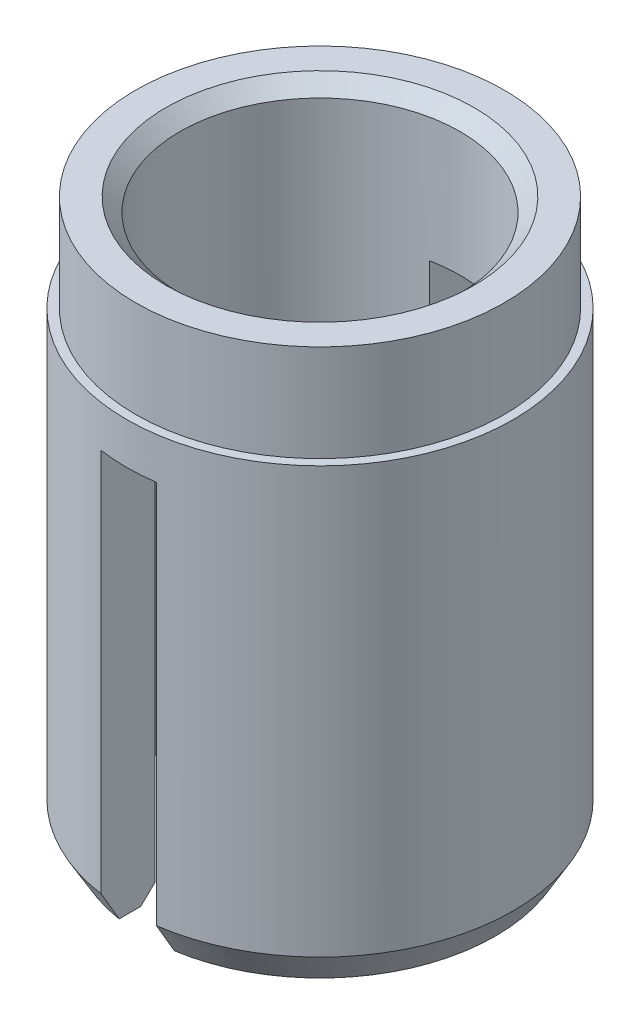
ISO-10303-21;
HEADER;
FILE_DESCRIPTION(('STEP AP214'),'2;1');
FILE_NAME('part.step','',(''),(''),'','','');
FILE_SCHEMA(('AUTOMOTIVE_DESIGN { 1 0 10303 214 1 1 1 1 }'));
ENDSEC;
DATA;
#1=APPLICATION_CONTEXT('core data for automotive mechanical design processes');
#2=APPLICATION_PROTOCOL_DEFINITION('international standard','automotive_design',2000,#1);
#3=PRODUCT_CONTEXT('',#1,'mechanical');
#4=PRODUCT('Part','Part','',(#3));
#5=PRODUCT_RELATED_PRODUCT_CATEGORY('part','',(#4));
#6=PRODUCT_DEFINITION_FORMATION('','',#4);
#7=PRODUCT_DEFINITION_CONTEXT('part definition',#1,'design');
#8=PRODUCT_DEFINITION('design','',#6,#7);
#9=PRODUCT_DEFINITION_SHAPE('','',#8);
#10=(LENGTH_UNIT() NAMED_UNIT(*) SI_UNIT(.MILLI.,.METRE.));
#11=(NAMED_UNIT(*) PLANE_ANGLE_UNIT() SI_UNIT($,.RADIAN.));
#12=(NAMED_UNIT(*) SI_UNIT($,.STERADIAN.) SOLID_ANGLE_UNIT());
#13=UNCERTAINTY_MEASURE_WITH_UNIT(LENGTH_MEASURE(1.E-05),#10,'distance_accuracy_value','');
#14=(GEOMETRIC_REPRESENTATION_CONTEXT(3) GLOBAL_UNCERTAINTY_ASSIGNED_CONTEXT((#13)) GLOBAL_UNIT_ASSIGNED_CONTEXT((#10,
#11,#12)) REPRESENTATION_CONTEXT('',''));
#15=CARTESIAN_POINT('',(0.,0.,0.));
#16=DIRECTION('',(0.,0.,1.));
#17=DIRECTION('',(1.,0.,0.));
#18=AXIS2_PLACEMENT_3D('',#15,#16,#17);
#19=CARTESIAN_POINT('',(0.,4.7625,0.));
#20=DIRECTION('',(0.,-1.,0.));
#21=DIRECTION('',(0.,0.,-1.));
#22=AXIS2_PLACEMENT_3D('',#19,#20,#21);
#23=CYLINDRICAL_SURFACE('',#22,3.3274);
#24=CARTESIAN_POINT('',(0.,3.095625,0.));
#25=DIRECTION('',(0.,1.,0.));
#26=DIRECTION('',(0.,0.,1.));
#27=AXIS2_PLACEMENT_3D('',#24,#25,#26);
#28=CIRCLE('',#27,3.3274);
#29=CARTESIAN_POINT('',(0.,3.095625,3.3274));
#30=VERTEX_POINT('',#29);
#31=EDGE_CURVE('E167',#30,#30,#28,.T.);
#32=ORIENTED_EDGE('',*,*,#31,.F.);
#33=EDGE_LOOP('',(#32));
#34=FACE_BOUND('',#33,.T.);
#35=DIRECTION('',(0.,-1.,0.));
#36=VECTOR('',#35,1.);
#37=CARTESIAN_POINT('',(0.476250000000001,4.7625,-3.29314085600662));
#38=LINE('',#37,#36);
#39=CARTESIAN_POINT('',(0.47625,2.38125,-3.29314085600662));
#40=VERTEX_POINT('',#39);
#41=CARTESIAN_POINT('',(0.476249999999999,-4.23457091385299,-3.29314085600662));
#42=VERTEX_POINT('',#41);
#43=EDGE_CURVE('E55',#40,#42,#38,.T.);
#44=ORIENTED_EDGE('',*,*,#43,.F.);
#45=CARTESIAN_POINT('',(0.,2.38125,0.));
#46=DIRECTION('',(0.,-1.,0.));
#47=DIRECTION('',(0.,0.,-1.));
#48=AXIS2_PLACEMENT_3D('',#45,#46,#47);
#49=CIRCLE('',#48,3.3274);
#50=CARTESIAN_POINT('',(-0.47625,2.38125,-3.29314085600662));
#51=VERTEX_POINT('',#50);
#52=EDGE_CURVE('E229',#51,#40,#49,.T.);
#53=ORIENTED_EDGE('',*,*,#52,.F.);
#54=DIRECTION('',(0.,-1.,0.));
#55=VECTOR('',#54,1.);
#56=CARTESIAN_POINT('',(-0.47625,4.7625,-3.29314085600662));
#57=LINE('',#56,#55);
#58=CARTESIAN_POINT('',(-0.476249999999999,-4.23457091385299,-3.29314085600662));
#59=VERTEX_POINT('',#58);
#60=EDGE_CURVE('E221',#59,#51,#57,.F.);
#61=ORIENTED_EDGE('',*,*,#60,.F.);
#62=CARTESIAN_POINT('',(0.,-4.23457091385299,0.));
#63=DIRECTION('',(0.,1.,0.));
#64=DIRECTION('',(0.,0.,1.));
#65=AXIS2_PLACEMENT_3D('',#62,#63,#64);
#66=CIRCLE('',#65,3.3274);
#67=CARTESIAN_POINT('',(-0.476249999999999,-4.23457091385299,3.29314085600662));
#68=VERTEX_POINT('',#67);
#69=EDGE_CURVE('E163',#59,#68,#66,.T.);
#70=ORIENTED_EDGE('',*,*,#69,.T.);
#71=DIRECTION('',(0.,-1.,0.));
#72=VECTOR('',#71,1.);
#73=CARTESIAN_POINT('',(-0.47625,4.7625,3.29314085600662));
#74=LINE('',#73,#72);
#75=CARTESIAN_POINT('',(-0.47625,2.38125,3.29314085600662));
#76=VERTEX_POINT('',#75);
#77=EDGE_CURVE('E277',#76,#68,#74,.T.);
#78=ORIENTED_EDGE('',*,*,#77,.F.);
#79=CARTESIAN_POINT('',(0.47625,2.38125,3.29314085600662));
#80=VERTEX_POINT('',#79);
#81=EDGE_CURVE('E158',#80,#76,#49,.T.);
#82=ORIENTED_EDGE('',*,*,#81,.F.);
#83=DIRECTION('',(0.,-1.,0.));
#84=VECTOR('',#83,1.);
#85=CARTESIAN_POINT('',(0.476250000000001,4.7625,3.29314085600662));
#86=LINE('',#85,#84);
#87=CARTESIAN_POINT('',(0.476249999999999,-4.23457091385299,3.29314085600662));
#88=VERTEX_POINT('',#87);
#89=EDGE_CURVE('E254',#88,#80,#86,.F.);
#90=ORIENTED_EDGE('',*,*,#89,.F.);
#91=EDGE_CURVE('E166',#88,#42,#66,.T.);
#92=ORIENTED_EDGE('',*,*,#91,.T.);
#93=EDGE_LOOP('',(#44,#53,#61,#70,#78,#82,#90,#92));
#94=FACE_BOUND('',#93,.T.);
#95=ADVANCED_FACE('F39',(#34,#94),#23,.T.);
#96=CARTESIAN_POINT('',(0.,4.7625,0.));
#97=DIRECTION('',(0.,-1.,0.));
#98=DIRECTION('',(0.,0.,-1.));
#99=AXIS2_PLACEMENT_3D('',#96,#97,#98);
#100=CYLINDRICAL_SURFACE('',#99,2.413);
#101=CARTESIAN_POINT('',(0.,4.52537515041018,0.));
#102=DIRECTION('',(0.,1.,0.));
#103=DIRECTION('',(0.,0.,1.));
#104=AXIS2_PLACEMENT_3D('',#101,#102,#103);
#105=CIRCLE('',#104,2.413);
#106=CARTESIAN_POINT('',(0.,4.52537515041018,2.413));
#107=VERTEX_POINT('',#106);
#108=EDGE_CURVE('E161',#107,#107,#105,.F.);
#109=ORIENTED_EDGE('',*,*,#108,.F.);
#110=EDGE_LOOP('',(#109));
#111=FACE_BOUND('',#110,.T.);
#112=CARTESIAN_POINT('',(0.,2.38125,0.));
#113=DIRECTION('',(0.,-1.,0.));
#114=DIRECTION('',(0.,0.,-1.));
#115=AXIS2_PLACEMENT_3D('',#112,#113,#114);
#116=CIRCLE('',#115,2.413);
#117=CARTESIAN_POINT('',(0.47625,2.38125,2.36553481003768));
#118=VERTEX_POINT('',#117);
#119=CARTESIAN_POINT('',(-0.47625,2.38125,2.36553481003768));
#120=VERTEX_POINT('',#119);
#121=EDGE_CURVE('E11',#118,#120,#116,.T.);
#122=ORIENTED_EDGE('',*,*,#121,.T.);
#123=DIRECTION('',(0.,-1.,0.));
#124=VECTOR('',#123,1.);
#125=CARTESIAN_POINT('',(-0.47625,4.7625,2.36553481003768));
#126=LINE('',#125,#124);
#127=CARTESIAN_POINT('',(-0.476249999999999,-4.52537515041018,2.36553481003768));
#128=VERTEX_POINT('',#127);
#129=EDGE_CURVE('E226',#120,#128,#126,.T.);
#130=ORIENTED_EDGE('',*,*,#129,.T.);
#131=CARTESIAN_POINT('',(0.,-4.52537515041018,0.));
#132=DIRECTION('',(0.,-1.,0.));
#133=DIRECTION('',(0.,0.,-1.));
#134=AXIS2_PLACEMENT_3D('',#131,#132,#133);
#135=CIRCLE('',#134,2.413);
#136=CARTESIAN_POINT('',(-0.476249999999999,-4.52537515041018,-2.36553481003768));
#137=VERTEX_POINT('',#136);
#138=EDGE_CURVE('E155',#137,#128,#135,.F.);
#139=ORIENTED_EDGE('',*,*,#138,.F.);
#140=DIRECTION('',(0.,-1.,0.));
#141=VECTOR('',#140,1.);
#142=CARTESIAN_POINT('',(-0.47625,4.7625,-2.36553481003768));
#143=LINE('',#142,#141);
#144=CARTESIAN_POINT('',(-0.47625,2.38125,-2.36553481003768));
#145=VERTEX_POINT('',#144);
#146=EDGE_CURVE('E220',#137,#145,#143,.F.);
#147=ORIENTED_EDGE('',*,*,#146,.T.);
#148=CARTESIAN_POINT('',(0.47625,2.38125,-2.36553481003768));
#149=VERTEX_POINT('',#148);
#150=EDGE_CURVE('E44',#145,#149,#116,.T.);
#151=ORIENTED_EDGE('',*,*,#150,.T.);
#152=DIRECTION('',(0.,-1.,0.));
#153=VECTOR('',#152,1.);
#154=CARTESIAN_POINT('',(0.476250000000001,4.7625,-2.36553481003768));
#155=LINE('',#154,#153);
#156=CARTESIAN_POINT('',(0.476249999999999,-4.52537515041018,-2.36553481003768));
#157=VERTEX_POINT('',#156);
#158=EDGE_CURVE('E276',#149,#157,#155,.T.);
#159=ORIENTED_EDGE('',*,*,#158,.T.);
#160=CARTESIAN_POINT('',(0.476249999999999,-4.52537515041018,2.36553481003768));
#161=VERTEX_POINT('',#160);
#162=EDGE_CURVE('E152',#161,#157,#135,.F.);
#163=ORIENTED_EDGE('',*,*,#162,.F.);
#164=DIRECTION('',(0.,-1.,0.));
#165=VECTOR('',#164,1.);
#166=CARTESIAN_POINT('',(0.476250000000001,4.7625,2.36553481003768));
#167=LINE('',#166,#165);
#168=EDGE_CURVE('E132',#161,#118,#167,.F.);
#169=ORIENTED_EDGE('',*,*,#168,.T.);
#170=EDGE_LOOP('',(#122,#130,#139,#147,#151,#159,#163,#169));
#171=FACE_BOUND('',#170,.T.);
#172=ADVANCED_FACE('F248',(#111,#171),#100,.F.);
#173=CARTESIAN_POINT('',(0.,-4.7625,0.));
#174=DIRECTION('',(0.,1.,0.));
#175=DIRECTION('',(0.,0.,1.));
#176=AXIS2_PLACEMENT_3D('',#173,#174,#175);
#177=PLANE('',#176);
#178=DIRECTION('',(0.,0.,-1.));
#179=VECTOR('',#178,1.);
#180=CARTESIAN_POINT('',(-0.476249999999999,-4.7625,3.3274));
#181=LINE('',#180,#179);
#182=CARTESIAN_POINT('',(-0.476249999999999,-4.7625,2.98484450139365));
#183=VERTEX_POINT('',#182);
#184=CARTESIAN_POINT('',(-0.476249999999999,-4.7625,2.61122469877642));
#185=VERTEX_POINT('',#184);
#186=EDGE_CURVE('E255',#183,#185,#181,.T.);
#187=ORIENTED_EDGE('',*,*,#186,.F.);
#188=CARTESIAN_POINT('',(0.,-4.7625,0.));
#189=DIRECTION('',(0.,1.,0.));
#190=DIRECTION('',(0.,0.,1.));
#191=AXIS2_PLACEMENT_3D('',#188,#189,#190);
#192=CIRCLE('',#191,3.02259999999999);
#193=CARTESIAN_POINT('',(-0.476249999999999,-4.7625,-2.98484450139365));
#194=VERTEX_POINT('',#193);
#195=EDGE_CURVE('E168',#183,#194,#192,.F.);
#196=ORIENTED_EDGE('',*,*,#195,.T.);
#197=CARTESIAN_POINT('',(-0.476249999999999,-4.7625,-2.61122469877642));
#198=VERTEX_POINT('',#197);
#199=EDGE_CURVE('E147',#198,#194,#181,.T.);
#200=ORIENTED_EDGE('',*,*,#199,.F.);
#201=CARTESIAN_POINT('',(0.,-4.7625,0.));
#202=DIRECTION('',(0.,1.,0.));
#203=DIRECTION('',(0.,0.,1.));
#204=AXIS2_PLACEMENT_3D('',#201,#202,#203);
#205=CIRCLE('',#204,2.6543);
#206=EDGE_CURVE('E153',#198,#185,#205,.T.);
#207=ORIENTED_EDGE('',*,*,#206,.T.);
#208=EDGE_LOOP('',(#187,#196,#200,#207));
#209=FACE_BOUND('',#208,.T.);
#210=ADVANCED_FACE('F305',(#209),#177,.F.);
#211=DIRECTION('',(0.,0.,-1.));
#212=VECTOR('',#211,1.);
#213=CARTESIAN_POINT('',(0.476249999999999,-4.7625,3.3274));
#214=LINE('',#213,#212);
#215=CARTESIAN_POINT('',(0.476249999999999,-4.7625,-2.61122469877642));
#216=VERTEX_POINT('',#215);
#217=CARTESIAN_POINT('',(0.476249999999999,-4.7625,-2.98484450139365));
#218=VERTEX_POINT('',#217);
#219=EDGE_CURVE('E148',#216,#218,#214,.T.);
#220=ORIENTED_EDGE('',*,*,#219,.T.);
#221=CARTESIAN_POINT('',(0.476249999999999,-4.7625,2.98484450139365));
#222=VERTEX_POINT('',#221);
#223=EDGE_CURVE('E146',#218,#222,#192,.F.);
#224=ORIENTED_EDGE('',*,*,#223,.T.);
#225=CARTESIAN_POINT('',(0.476249999999999,-4.7625,2.61122469877642));
#226=VERTEX_POINT('',#225);
#227=EDGE_CURVE('E63',#222,#226,#214,.T.);
#228=ORIENTED_EDGE('',*,*,#227,.T.);
#229=EDGE_CURVE('E144',#226,#216,#205,.T.);
#230=ORIENTED_EDGE('',*,*,#229,.T.);
#231=EDGE_LOOP('',(#220,#224,#228,#230));
#232=FACE_BOUND('',#231,.T.);
#233=ADVANCED_FACE('F143',(#232),#177,.F.);
#234=CARTESIAN_POINT('',(0.,-4.7625,0.));
#235=DIRECTION('',(0.,-1.,0.));
#236=DIRECTION('',(0.,0.,-1.));
#237=AXIS2_PLACEMENT_3D('',#234,#235,#236);
#238=CONICAL_SURFACE('',#237,2.6543,0.794124809657422);
#239=CARTESIAN_POINT('',(-0.476249999999999,-7.91490776072184,5.84283598849705));
#240=CARTESIAN_POINT('',(-0.476249999999999,-7.70976544698418,5.63338300201591));
#241=CARTESIAN_POINT('',(-0.476249999999999,-7.50465431074887,5.42389944310753));
#242=CARTESIAN_POINT('',(-0.476249999999999,-7.09452683376606,5.00481715941839));
#243=CARTESIAN_POINT('',(-0.476249999999999,-6.88951049880745,4.79521842897282));
#244=CARTESIAN_POINT('',(-0.476249999999999,-6.47936304131701,4.37560410594732));
#245=CARTESIAN_POINT('',(-0.476249999999999,-6.27423211200955,4.1655883244482));
#246=CARTESIAN_POINT('',(-0.476249999999999,-5.86421530529836,3.74533945331727));
#247=CARTESIAN_POINT('',(-0.476249999999999,-5.65932941544137,3.53510637583749));
#248=CARTESIAN_POINT('',(-0.476249999999999,-5.26144819139332,3.12609180772019));
#249=CARTESIAN_POINT('',(-0.476249999999999,-5.06843179827001,2.92733082355204));
#250=CARTESIAN_POINT('',(-0.476249999999999,-4.77936131498263,2.62871851918451));
#251=CARTESIAN_POINT('',(-0.476249999999999,-4.68307243608281,2.52909457169074));
#252=CARTESIAN_POINT('',(-0.476249999999999,-4.49072088726669,2.3296315121383));
#253=CARTESIAN_POINT('',(-0.476249999999999,-4.39465821379207,2.22979240351219));
#254=CARTESIAN_POINT('',(-0.476249999999999,-4.20293509603182,2.02987687000661));
#255=CARTESIAN_POINT('',(-0.476249999999999,-4.10727439757079,1.92980068923823));
#256=CARTESIAN_POINT('',(-0.476249999999999,-3.91645976466851,1.72915469365592));
#257=CARTESIAN_POINT('',(-0.476249999999999,-3.82130586135148,1.62858484923676));
#258=CARTESIAN_POINT('',(-0.476249999999999,-3.63186800012579,1.42667749806565));
#259=CARTESIAN_POINT('',(-0.476249999999999,-3.53758380576027,1.32534021447907));
#260=CARTESIAN_POINT('',(-0.476249999999999,-3.39737968249402,1.17222294296789));
#261=CARTESIAN_POINT('',(-0.476249999999999,-3.35085093222079,1.12100117962794));
#262=CARTESIAN_POINT('',(-0.476249999999999,-3.25839562388543,1.01801781131334));
#263=CARTESIAN_POINT('',(-0.476249999999999,-3.21246904405972,0.96625622597096));
#264=CARTESIAN_POINT('',(-0.476249999999999,-3.14226433470923,0.885696772876432));
#265=CARTESIAN_POINT('',(-0.476249999999999,-3.11765906984574,0.857184279744419));
#266=CARTESIAN_POINT('',(-0.476249999999999,-3.0688085411334,0.799847157967971));
#267=CARTESIAN_POINT('',(-0.476249999999999,-3.04456331160753,0.771022500011403));
#268=CARTESIAN_POINT('',(-0.476249999999999,-2.99632984457963,0.712699692596412));
#269=CARTESIAN_POINT('',(-0.476249999999999,-2.97234616807558,0.683197758717965));
#270=CARTESIAN_POINT('',(-0.476249999999999,-2.92506322879845,0.623659453868963));
#271=CARTESIAN_POINT('',(-0.476249999999999,-2.90176380172264,0.593623214024523));
#272=CARTESIAN_POINT('',(-0.476249999999999,-2.85589988178249,0.532504851088645));
#273=CARTESIAN_POINT('',(-0.476249999999999,-2.83334540978116,0.501415149266991));
#274=CARTESIAN_POINT('',(-0.476249999999999,-2.78968941271432,0.438161434260688));
#275=CARTESIAN_POINT('',(-0.476249999999999,-2.76858972619112,0.40599613527409));
#276=CARTESIAN_POINT('',(-0.476249999999999,-2.72890270630898,0.340512969863864));
#277=CARTESIAN_POINT('',(-0.476249999999999,-2.71029460546646,0.307207972826892));
#278=CARTESIAN_POINT('',(-0.476249999999999,-2.67685934240393,0.238797652814545));
#279=CARTESIAN_POINT('',(-0.476249999999999,-2.66202143842192,0.203697794819846));
#280=CARTESIAN_POINT('',(-0.476249999999999,-2.63928645490339,0.133856212561441));
#281=CARTESIAN_POINT('',(-0.476249999999999,-2.63097835489072,0.0992594209630319));
#282=CARTESIAN_POINT('',(-0.476249999999999,-2.6240740305203,0.0467396522177614));
#283=CARTESIAN_POINT('',(-0.476249999999999,-2.62269540501723,0.0291743987399413));
#284=CARTESIAN_POINT('',(-0.476249999999999,-2.62185402838716,-0.00600072242025813));
#285=CARTESIAN_POINT('',(-0.476249999999999,-2.62239125916846,-0.0236105896797737));
#286=CARTESIAN_POINT('',(-0.476249999999999,-2.62684256981975,-0.0760536903789706));
#287=CARTESIAN_POINT('',(-0.476249999999999,-2.63357407948616,-0.110671840424017));
#288=CARTESIAN_POINT('',(-0.476249999999999,-2.64800845192288,-0.161376231049064));
#289=CARTESIAN_POINT('',(-0.476249999999999,-2.65357786016827,-0.178146758287314));
#290=CARTESIAN_POINT('',(-0.476249999999999,-2.66589331575859,-0.211252301290742));
#291=CARTESIAN_POINT('',(-0.476249999999999,-2.67263919102418,-0.227587380345725));
#292=CARTESIAN_POINT('',(-0.476249999999999,-2.69254971319153,-0.272076533638428));
#293=CARTESIAN_POINT('',(-0.476249999999999,-2.70669844508863,-0.299785490904233));
#294=CARTESIAN_POINT('',(-0.476249999999999,-2.73693069308907,-0.354138265048347));
#295=CARTESIAN_POINT('',(-0.476249999999999,-2.75301640861333,-0.380780824446132));
#296=CARTESIAN_POINT('',(-0.476249999999999,-2.78655405564219,-0.433311515915414));
#297=CARTESIAN_POINT('',(-0.476249999999999,-2.80401045555252,-0.459196768078805));
#298=CARTESIAN_POINT('',(-0.476249999999999,-2.8398507573449,-0.510320170274036));
#299=CARTESIAN_POINT('',(-0.476249999999999,-2.85823488191855,-0.535558162723427));
#300=CARTESIAN_POINT('',(-0.476249999999999,-2.91469803292623,-0.610968812975209));
#301=CARTESIAN_POINT('',(-0.476249999999999,-2.95378395094106,-0.660384228984071));
#302=CARTESIAN_POINT('',(-0.476249999999999,-3.03333496824237,-0.757876469669391));
#303=CARTESIAN_POINT('',(-0.476249999999999,-3.07379659678584,-0.805956176912251));
#304=CARTESIAN_POINT('',(-0.476249999999999,-3.15476899795416,-0.900310077260223));
#305=CARTESIAN_POINT('',(-0.476249999999999,-3.19526040842089,-0.94660092021169));
#306=CARTESIAN_POINT('',(-0.476249999999999,-3.2768301699295,-1.03866214349386));
#307=CARTESIAN_POINT('',(-0.476249999999999,-3.3179085344593,-1.08443251182077));
#308=CARTESIAN_POINT('',(-0.476249999999999,-3.44175734505045,-1.22120879035854));
#309=CARTESIAN_POINT('',(-0.476249999999999,-3.52513090862866,-1.31166774482816));
#310=CARTESIAN_POINT('',(-0.476249999999999,-3.69283388187815,-1.49188938293826));
#311=CARTESIAN_POINT('',(-0.476249999999999,-3.77716430290982,-1.58165111956175));
#312=CARTESIAN_POINT('',(-0.476249999999999,-3.94634783697629,-1.76066809309096));
#313=CARTESIAN_POINT('',(-0.476249999999999,-4.03120091156274,-1.84992336634748));
#314=CARTESIAN_POINT('',(-0.476249999999999,-4.20047543896292,-2.02729656143101));
#315=CARTESIAN_POINT('',(-0.476249999999999,-4.28489379529147,-2.11541744299464));
#316=CARTESIAN_POINT('',(-0.476249999999999,-4.45396480806389,-2.29143725431605));
#317=CARTESIAN_POINT('',(-0.476249999999999,-4.53861746888803,-2.37933617986486));
#318=CARTESIAN_POINT('',(-0.476249999999999,-4.79274664137239,-2.64271752593369));
#319=CARTESIAN_POINT('',(-0.476249999999999,-4.96246907857687,-2.81796255404857));
#320=CARTESIAN_POINT('',(-0.476249999999999,-5.36231919352317,-3.22996915258786));
#321=CARTESIAN_POINT('',(-0.476249999999999,-5.59259750049424,-3.46658437616365));
#322=CARTESIAN_POINT('',(-0.476249999999999,-6.05354581288301,-3.93950727213864));
#323=CARTESIAN_POINT('',(-0.476249999999999,-6.28421587553131,-4.1758148887241));
#324=CARTESIAN_POINT('',(-0.476249999999999,-6.74816169396201,-4.65067327263492));
#325=CARTESIAN_POINT('',(-0.476249999999999,-6.98143965846325,-4.88922188137859));
#326=CARTESIAN_POINT('',(-0.476249999999999,-7.4481020422674,-5.36613772376891));
#327=CARTESIAN_POINT('',(-0.476249999999999,-7.68148643757594,-5.60450498089173));
#328=CARTESIAN_POINT('',(-0.476249999999999,-7.91490776072184,-5.84283598849705));
#329=B_SPLINE_CURVE_WITH_KNOTS('',3,(#239,#240,#241,#242,#243,#244,#245,#246,#247,#248,#249,
#250,#251,#252,#253,#254,#255,#256,#257,#258,#259,#260,#261,#262,#263,#264,#265,#266,#267,#268,
#269,#270,#271,#272,#273,#274,#275,#276,#277,#278,#279,#280,#281,#282,#283,#284,#285,#286,#287,
#288,#289,#290,#291,#292,#293,#294,#295,#296,#297,#298,#299,#300,#301,#302,#303,#304,#305,#306,
#307,#308,#309,#310,#311,#312,#313,#314,#315,#316,#317,#318,#319,#320,#321,#322,#323,#324,#325,
#326,#327,#328),.UNSPECIFIED.,.F.,.F.,(4,2,2,2,2,2,2,2,2,2,2,2,2,2,2,2,2,2,2,2,2,2,2,2,2,2,2,2,
2,2,2,2,2,2,2,2,2,2,2,2,2,2,2,2,4),(0.,0.879537016251924,1.75912206714881,2.63984206445831,
3.52051521905059,4.35168896844187,4.76734279100068,5.1829900308425,5.59831490544366,
6.01366499922189,6.42889862600072,6.63649498024415,6.84408381076046,6.95706582928637,
7.07005855037759,7.18411387290502,7.2981415806195,7.41334182126037,7.52868507879914,
7.64299752365807,7.75698053080648,7.86303461550489,7.915794123851,7.96855313398253,
8.07356384467947,8.12654962047242,8.17952765263822,8.27273806682852,8.36605533641025,
8.45969056950712,8.55334838678004,8.74230024177798,8.93080639005563,9.11530178816337,
9.29980143272502,9.66884903763918,10.0383319006181,10.4077879001791,10.773882660377,
11.139984311475,11.8718634585864,12.8623847984222,13.8530660372178,14.8540237207622,
15.8548158190171),.UNSPECIFIED.);
#330=EDGE_CURVE('E222',#185,#128,#329,.T.);
#331=ORIENTED_EDGE('',*,*,#330,.F.);
#332=ORIENTED_EDGE('',*,*,#206,.F.);
#333=EDGE_CURVE('E213',#137,#198,#329,.T.);
#334=ORIENTED_EDGE('',*,*,#333,.F.);
#335=ORIENTED_EDGE('',*,*,#138,.T.);
#336=EDGE_LOOP('',(#331,#332,#334,#335));
#337=FACE_BOUND('',#336,.T.);
#338=ADVANCED_FACE('F204',(#337),#238,.F.);
#339=CARTESIAN_POINT('',(0.476249999999998,-7.91490776072184,-5.84283598849705));
#340=CARTESIAN_POINT('',(0.476249999999998,-7.70976544698418,-5.63338300201591));
#341=CARTESIAN_POINT('',(0.476249999999998,-7.50465431074887,-5.42389944310753));
#342=CARTESIAN_POINT('',(0.476249999999999,-7.09452683376606,-5.00481715941839));
#343=CARTESIAN_POINT('',(0.476249999999999,-6.88951049880746,-4.79521842897282));
#344=CARTESIAN_POINT('',(0.476249999999999,-6.47936304131702,-4.37560410594733));
#345=CARTESIAN_POINT('',(0.476249999999999,-6.27423211200956,-4.1655883244482));
#346=CARTESIAN_POINT('',(0.476249999999999,-5.86421530529836,-3.74533945331727));
#347=CARTESIAN_POINT('',(0.476249999999999,-5.65932941544137,-3.5351063758375));
#348=CARTESIAN_POINT('',(0.476249999999999,-5.26144819139333,-3.1260918077202));
#349=CARTESIAN_POINT('',(0.476249999999999,-5.06843179827001,-2.92733082355205));
#350=CARTESIAN_POINT('',(0.476249999999999,-4.77936131498264,-2.62871851918451));
#351=CARTESIAN_POINT('',(0.476249999999999,-4.68307243608281,-2.52909457169074));
#352=CARTESIAN_POINT('',(0.476249999999999,-4.49072088726669,-2.32963151213831));
#353=CARTESIAN_POINT('',(0.476249999999999,-4.39465821379208,-2.2297924035122));
#354=CARTESIAN_POINT('',(0.476249999999999,-4.20293509603182,-2.02987687000662));
#355=CARTESIAN_POINT('',(0.476249999999999,-4.10727439757079,-1.92980068923823));
#356=CARTESIAN_POINT('',(0.476249999999999,-3.91645976466851,-1.72915469365592));
#357=CARTESIAN_POINT('',(0.476249999999999,-3.82130586135148,-1.62858484923676));
#358=CARTESIAN_POINT('',(0.476249999999999,-3.63186800012579,-1.42667749806566));
#359=CARTESIAN_POINT('',(0.476249999999999,-3.53758380576027,-1.32534021447908));
#360=CARTESIAN_POINT('',(0.476249999999999,-3.39737968249402,-1.17222294296789));
#361=CARTESIAN_POINT('',(0.476249999999999,-3.35085093222079,-1.12100117962794));
#362=CARTESIAN_POINT('',(0.476249999999999,-3.25839562388543,-1.01801781131334));
#363=CARTESIAN_POINT('',(0.476249999999999,-3.21246904405972,-0.96625622597096));
#364=CARTESIAN_POINT('',(0.476249999999999,-3.14226433470923,-0.885696772876432));
#365=CARTESIAN_POINT('',(0.476249999999999,-3.11765906984574,-0.857184279744419));
#366=CARTESIAN_POINT('',(0.476249999999999,-3.06880854113339,-0.79984715796797));
#367=CARTESIAN_POINT('',(0.476249999999999,-3.04456331160753,-0.771022500011403));
#368=CARTESIAN_POINT('',(0.476249999999999,-2.99632984457963,-0.712699692596412));
#369=CARTESIAN_POINT('',(0.476249999999999,-2.97234616807558,-0.683197758717965));
#370=CARTESIAN_POINT('',(0.476249999999999,-2.92506322879845,-0.623659453868963));
#371=CARTESIAN_POINT('',(0.476249999999999,-2.90176380172264,-0.593623214024523));
#372=CARTESIAN_POINT('',(0.476249999999999,-2.85589988178249,-0.532504851088645));
#373=CARTESIAN_POINT('',(0.476249999999999,-2.83334540978116,-0.501415149266992));
#374=CARTESIAN_POINT('',(0.476249999999999,-2.78968941271432,-0.438161434260688));
#375=CARTESIAN_POINT('',(0.476249999999999,-2.76858972619112,-0.405996135274091));
#376=CARTESIAN_POINT('',(0.476249999999999,-2.72890270630898,-0.340512969863864));
#377=CARTESIAN_POINT('',(0.476249999999999,-2.71029460546646,-0.307207972826893));
#378=CARTESIAN_POINT('',(0.476249999999999,-2.67685934240392,-0.238797652814547));
#379=CARTESIAN_POINT('',(0.476249999999999,-2.66202143842192,-0.203697794819847));
#380=CARTESIAN_POINT('',(0.476249999999999,-2.63928645490338,-0.133856212561443));
#381=CARTESIAN_POINT('',(0.476249999999999,-2.63097835489072,-0.0992594209630333));
#382=CARTESIAN_POINT('',(0.476249999999999,-2.6240740305203,-0.0467396522177622));
#383=CARTESIAN_POINT('',(0.476249999999999,-2.62269540501722,-0.0291743987399416));
#384=CARTESIAN_POINT('',(0.476249999999999,-2.62185402838716,0.00600072242025788));
#385=CARTESIAN_POINT('',(0.476249999999999,-2.62239125916846,0.0236105896797729));
#386=CARTESIAN_POINT('',(0.476249999999999,-2.62684256981975,0.0760536903789697));
#387=CARTESIAN_POINT('',(0.476249999999999,-2.63357407948616,0.110671840424017));
#388=CARTESIAN_POINT('',(0.476249999999999,-2.64800845192287,0.161376231049064));
#389=CARTESIAN_POINT('',(0.476249999999999,-2.65357786016827,0.178146758287313));
#390=CARTESIAN_POINT('',(0.476249999999999,-2.66589331575859,0.211252301290741));
#391=CARTESIAN_POINT('',(0.476249999999999,-2.67263919102418,0.227587380345723));
#392=CARTESIAN_POINT('',(0.476249999999999,-2.69254971319153,0.272076533638427));
#393=CARTESIAN_POINT('',(0.476249999999999,-2.70669844508862,0.299785490904232));
#394=CARTESIAN_POINT('',(0.476249999999999,-2.73693069308906,0.354138265048346));
#395=CARTESIAN_POINT('',(0.476249999999999,-2.75301640861333,0.380780824446131));
#396=CARTESIAN_POINT('',(0.476249999999999,-2.78655405564219,0.433311515915412));
#397=CARTESIAN_POINT('',(0.476249999999999,-2.80401045555252,0.459196768078803));
#398=CARTESIAN_POINT('',(0.476249999999999,-2.83985075734489,0.510320170274034));
#399=CARTESIAN_POINT('',(0.476249999999999,-2.85823488191855,0.535558162723425));
#400=CARTESIAN_POINT('',(0.476249999999999,-2.91469803292623,0.610968812975206));
#401=CARTESIAN_POINT('',(0.476249999999999,-2.95378395094106,0.660384228984067));
#402=CARTESIAN_POINT('',(0.476249999999999,-3.03333496824237,0.757876469669387));
#403=CARTESIAN_POINT('',(0.476249999999999,-3.07379659678584,0.805956176912246));
#404=CARTESIAN_POINT('',(0.476249999999999,-3.15476899795415,0.900310077260217));
#405=CARTESIAN_POINT('',(0.476249999999999,-3.19526040842088,0.946600920211685));
#406=CARTESIAN_POINT('',(0.476249999999999,-3.2768301699295,1.03866214349385));
#407=CARTESIAN_POINT('',(0.476249999999999,-3.31790853445929,1.08443251182076));
#408=CARTESIAN_POINT('',(0.476249999999999,-3.44175734505044,1.22120879035853));
#409=CARTESIAN_POINT('',(0.476249999999999,-3.52513090862865,1.31166774482815));
#410=CARTESIAN_POINT('',(0.476249999999999,-3.69283388187814,1.49188938293825));
#411=CARTESIAN_POINT('',(0.476249999999999,-3.77716430290981,1.58165111956174));
#412=CARTESIAN_POINT('',(0.476249999999999,-3.94634783697627,1.76066809309095));
#413=CARTESIAN_POINT('',(0.476249999999999,-4.03120091156273,1.84992336634746));
#414=CARTESIAN_POINT('',(0.476249999999999,-4.20047543896291,2.027296561431));
#415=CARTESIAN_POINT('',(0.476249999999999,-4.28489379529145,2.11541744299463));
#416=CARTESIAN_POINT('',(0.476249999999999,-4.45396480806388,2.29143725431603));
#417=CARTESIAN_POINT('',(0.476249999999999,-4.53861746888801,2.37933617986484));
#418=CARTESIAN_POINT('',(0.476249999999999,-4.79274664137237,2.64271752593367));
#419=CARTESIAN_POINT('',(0.476249999999999,-4.96246907857685,2.81796255404856));
#420=CARTESIAN_POINT('',(0.476249999999999,-5.36231919352315,3.22996915258784));
#421=CARTESIAN_POINT('',(0.476249999999999,-5.59259750049423,3.46658437616363));
#422=CARTESIAN_POINT('',(0.476249999999999,-6.05354581288299,3.93950727213863));
#423=CARTESIAN_POINT('',(0.476249999999999,-6.2842158755313,4.17581488872408));
#424=CARTESIAN_POINT('',(0.476249999999999,-6.748161693962,4.65067327263491));
#425=CARTESIAN_POINT('',(0.476249999999999,-6.98143965846324,4.88922188137858));
#426=CARTESIAN_POINT('',(0.476249999999998,-7.4481020422674,5.3661377237689));
#427=CARTESIAN_POINT('',(0.476249999999998,-7.68148643757594,5.60450498089173));
#428=CARTESIAN_POINT('',(0.476249999999998,-7.91490776072184,5.84283598849705));
#429=B_SPLINE_CURVE_WITH_KNOTS('',3,(#339,#340,#341,#342,#343,#344,#345,#346,#347,#348,#349,
#350,#351,#352,#353,#354,#355,#356,#357,#358,#359,#360,#361,#362,#363,#364,#365,#366,#367,#368,
#369,#370,#371,#372,#373,#374,#375,#376,#377,#378,#379,#380,#381,#382,#383,#384,#385,#386,#387,
#388,#389,#390,#391,#392,#393,#394,#395,#396,#397,#398,#399,#400,#401,#402,#403,#404,#405,#406,
#407,#408,#409,#410,#411,#412,#413,#414,#415,#416,#417,#418,#419,#420,#421,#422,#423,#424,#425,
#426,#427,#428),.UNSPECIFIED.,.F.,.F.,(4,2,2,2,2,2,2,2,2,2,2,2,2,2,2,2,2,2,2,2,2,2,2,2,2,2,2,2,
2,2,2,2,2,2,2,2,2,2,2,2,2,2,2,2,4),(0.,0.879537016251922,1.75912206714881,2.6398420644583,
3.52051521905058,4.35168896844185,4.76734279100068,5.1829900308425,5.59831490544365,
6.01366499922189,6.42889862600072,6.63649498024416,6.84408381076046,6.95706582928638,
7.07005855037759,7.18411387290502,7.2981415806195,7.41334182126037,7.52868507879914,
7.64299752365807,7.75698053080648,7.86303461550489,7.915794123851,7.96855313398253,
8.07356384467947,8.12654962047242,8.17952765263822,8.27273806682852,8.36605533641026,
8.45969056950712,8.55334838678004,8.74230024177798,8.93080639005563,9.11530178816337,
9.29980143272502,9.66884903763917,10.0383319006181,10.407787900179,10.773882660377,
11.139984311475,11.8718634585864,12.8623847984222,13.8530660372177,14.8540237207622,
15.8548158190171),.UNSPECIFIED.);
#430=EDGE_CURVE('E138',#216,#157,#429,.T.);
#431=ORIENTED_EDGE('',*,*,#430,.F.);
#432=ORIENTED_EDGE('',*,*,#229,.F.);
#433=EDGE_CURVE('E128',#161,#226,#429,.T.);
#434=ORIENTED_EDGE('',*,*,#433,.F.);
#435=ORIENTED_EDGE('',*,*,#162,.T.);
#436=EDGE_LOOP('',(#431,#432,#434,#435));
#437=FACE_BOUND('',#436,.T.);
#438=ADVANCED_FACE('F151',(#437),#238,.F.);
#439=CARTESIAN_POINT('',(0.,-4.23457091385299,0.));
#440=DIRECTION('',(0.,1.,0.));
#441=DIRECTION('',(0.,0.,1.));
#442=AXIS2_PLACEMENT_3D('',#439,#440,#441);
#443=CONICAL_SURFACE('',#442,3.3274,0.523598775598299);
#444=ORIENTED_EDGE('',*,*,#69,.F.);
#445=CARTESIAN_POINT('',(-0.476249999999999,-1.30816408617986,-4.99430589134129));
#446=CARTESIAN_POINT('',(-0.476249999999999,-1.59771693246135,-4.82636860839637));
#447=CARTESIAN_POINT('',(-0.476249999999999,-1.88724120616147,-4.65838199711442));
#448=CARTESIAN_POINT('',(-0.476249999999999,-2.46619411058673,-4.32225170719463));
#449=CARTESIAN_POINT('',(-0.476249999999999,-2.75562274237204,-4.1541080303827));
#450=CARTESIAN_POINT('',(-0.476249999999999,-3.33433831172933,-3.81760960419695));
#451=CARTESIAN_POINT('',(-0.476249999999999,-3.62362525555982,-3.64925486559031));
#452=CARTESIAN_POINT('',(-0.476249999999999,-4.20201004430712,-3.3122132475355));
#453=CARTESIAN_POINT('',(-0.476249999999999,-4.49110788702566,-3.14352636431453));
#454=CARTESIAN_POINT('',(-0.476249999999999,-5.06902730361154,-2.8056198561999));
#455=CARTESIAN_POINT('',(-0.476249999999999,-5.35784885030516,-2.63640018477508));
#456=CARTESIAN_POINT('',(-0.476249999999999,-5.79067472968662,-2.38188942423438));
#457=CARTESIAN_POINT('',(-0.476249999999999,-5.93488007094204,-2.29694027180526));
#458=CARTESIAN_POINT('',(-0.476249999999999,-6.22310352679515,-2.12672189462073));
#459=CARTESIAN_POINT('',(-0.476249999999999,-6.36712163978259,-2.04145266713674));
#460=CARTESIAN_POINT('',(-0.476249999999999,-6.65490132080254,-1.87044874193216));
#461=CARTESIAN_POINT('',(-0.476249999999999,-6.79866286108313,-1.78471399748605));
#462=CARTESIAN_POINT('',(-0.476249999999999,-7.08577369088819,-1.61256290370853));
#463=CARTESIAN_POINT('',(-0.476249999999999,-7.2291229900645,-1.52614657051547));
#464=CARTESIAN_POINT('',(-0.476249999999999,-7.44364799667892,-1.39568209750929));
#465=CARTESIAN_POINT('',(-0.476249999999999,-7.51507735654568,-1.35205135660397));
#466=CARTESIAN_POINT('',(-0.476249999999999,-7.65770622036382,-1.26441746032629));
#467=CARTESIAN_POINT('',(-0.476249999999999,-7.72890572699974,-1.22041430932534));
#468=CARTESIAN_POINT('',(-0.476249999999999,-7.8710031414979,-1.13190901036702));
#469=CARTESIAN_POINT('',(-0.476249999999999,-7.94190102393899,-1.08740682145612));
#470=CARTESIAN_POINT('',(-0.476249999999999,-8.08323983963482,-0.997677168291789));
#471=CARTESIAN_POINT('',(-0.476249999999998,-8.15368075410735,-0.952449674488975));
#472=CARTESIAN_POINT('',(-0.476249999999999,-8.22381556651206,-0.906746404500965));
#473=B_SPLINE_CURVE_WITH_KNOTS('',3,(#445,#446,#447,#448,#449,#450,#451,#452,#453,#454,#455,
#456,#457,#458,#459,#460,#461,#462,#463,#464,#465,#466,#467,#468,#469,#470,#471,#472),
.UNSPECIFIED.,.F.,.F.,(4,2,2,2,2,2,2,2,2,2,2,2,2,4),(0.,1.00418828887457,2.00836504567447,
3.01249250550935,4.01663143772802,5.02086064407219,5.5229598237675,6.02506329354526,
6.52721812883133,7.02936110980019,7.28046210312954,7.53156015307581,7.78267896241275,
8.03380802861498),.UNSPECIFIED.);
#474=EDGE_CURVE('E282',#59,#194,#473,.T.);
#475=ORIENTED_EDGE('',*,*,#474,.T.);
#476=ORIENTED_EDGE('',*,*,#195,.F.);
#477=CARTESIAN_POINT('',(-0.476249999999999,-8.22381556651206,0.906746404500965));
#478=CARTESIAN_POINT('',(-0.476249999999999,-8.17612983804011,0.937836292160526));
#479=CARTESIAN_POINT('',(-0.476249999999999,-8.12829448379402,0.968694813370335));
#480=CARTESIAN_POINT('',(-0.476249999999999,-8.03238562203966,1.03003747764373));
#481=CARTESIAN_POINT('',(-0.476249999999999,-7.9843121197066,1.06052162879313));
#482=CARTESIAN_POINT('',(-0.476249999999999,-7.83982875453769,1.15154338250693));
#483=CARTESIAN_POINT('',(-0.476249999999999,-7.74315024951891,1.21165402534776));
#484=CARTESIAN_POINT('',(-0.476249999999999,-7.54935132194937,1.33113350901183));
#485=CARTESIAN_POINT('',(-0.476249999999999,-7.45223094625438,1.3905024260966));
#486=CARTESIAN_POINT('',(-0.476249999999999,-7.25767904887957,1.50873205973918));
#487=CARTESIAN_POINT('',(-0.476249999999999,-7.16024752116074,1.56759276635022));
#488=CARTESIAN_POINT('',(-0.476249999999999,-6.87340804767646,1.74016044490129));
#489=CARTESIAN_POINT('',(-0.476249999999999,-6.6837018888453,1.85337128319792));
#490=CARTESIAN_POINT('',(-0.476249999999999,-6.30383301484205,2.07902057280857));
#491=CARTESIAN_POINT('',(-0.476249999999999,-6.11367030159056,2.19145902736418));
#492=CARTESIAN_POINT('',(-0.476249999999999,-5.54272274386496,2.52808145010884));
#493=CARTESIAN_POINT('',(-0.476249999999999,-5.16151627670517,2.75154993782995));
#494=CARTESIAN_POINT('',(-0.476249999999999,-4.49107182431951,3.14354145905981));
#495=CARTESIAN_POINT('',(-0.476249999999999,-4.20194257896323,3.31225100207974));
#496=CARTESIAN_POINT('',(-0.476249999999999,-3.62348909755182,3.64933576819746));
#497=CARTESIAN_POINT('',(-0.476249999999999,-3.33416486146563,3.81771099124197));
#498=CARTESIAN_POINT('',(-0.476249999999999,-2.75544534689307,4.15421064506903));
#499=CARTESIAN_POINT('',(-0.476249999999999,-2.46605009288035,4.32233511796786));
#500=CARTESIAN_POINT('',(-0.476249999999999,-1.88716754786148,4.65842496649968));
#501=CARTESIAN_POINT('',(-0.476249999999999,-1.59768025693631,4.82639034227214));
#502=CARTESIAN_POINT('',(-0.476249999999999,-1.30816408617986,4.99430589134129));
#503=B_SPLINE_CURVE_WITH_KNOTS('',3,(#477,#478,#479,#480,#481,#482,#483,#484,#485,#486,#487,
#488,#489,#490,#491,#492,#493,#494,#495,#496,#497,#498,#499,#500,#501,#502),.UNSPECIFIED.,.F.,
.F.,(4,2,2,2,2,2,2,2,2,2,2,2,4),(0.,0.17077426550377,0.3415448360397,0.683065315197669,
1.02455038660936,1.36604212653577,2.02879472963439,2.6915445495606,4.01717620513764,
5.02143103533535,6.02568602555314,7.02974727469357,8.0338076428421),.UNSPECIFIED.);
#504=EDGE_CURVE('E286',#183,#68,#503,.T.);
#505=ORIENTED_EDGE('',*,*,#504,.T.);
#506=EDGE_LOOP('',(#444,#475,#476,#505));
#507=FACE_BOUND('',#506,.T.);
#508=ADVANCED_FACE('F41',(#507),#443,.T.);
#509=ORIENTED_EDGE('',*,*,#223,.F.);
#510=CARTESIAN_POINT('',(0.476249999999998,-8.22381556651206,-0.906746404500965));
#511=CARTESIAN_POINT('',(0.476249999999998,-8.17612983804011,-0.937836292160526));
#512=CARTESIAN_POINT('',(0.476249999999998,-8.12829448379402,-0.968694813370336));
#513=CARTESIAN_POINT('',(0.476249999999998,-8.03238562203966,-1.03003747764373));
#514=CARTESIAN_POINT('',(0.476249999999998,-7.9843121197066,-1.06052162879313));
#515=CARTESIAN_POINT('',(0.476249999999998,-7.83982875453769,-1.15154338250694));
#516=CARTESIAN_POINT('',(0.476249999999998,-7.74315024951891,-1.21165402534776));
#517=CARTESIAN_POINT('',(0.476249999999998,-7.54935132194937,-1.33113350901183));
#518=CARTESIAN_POINT('',(0.476249999999998,-7.45223094625438,-1.3905024260966));
#519=CARTESIAN_POINT('',(0.476249999999998,-7.25767904887957,-1.50873205973918));
#520=CARTESIAN_POINT('',(0.476249999999999,-7.16024752116074,-1.56759276635022));
#521=CARTESIAN_POINT('',(0.476249999999999,-6.87340804767646,-1.74016044490129));
#522=CARTESIAN_POINT('',(0.476249999999999,-6.6837018888453,-1.85337128319792));
#523=CARTESIAN_POINT('',(0.476249999999999,-6.30383301484205,-2.07902057280857));
#524=CARTESIAN_POINT('',(0.476249999999999,-6.11367030159056,-2.19145902736418));
#525=CARTESIAN_POINT('',(0.476249999999999,-5.54272274386496,-2.52808145010884));
#526=CARTESIAN_POINT('',(0.476249999999999,-5.16151627670517,-2.75154993782995));
#527=CARTESIAN_POINT('',(0.476249999999999,-4.49107182431951,-3.14354145905981));
#528=CARTESIAN_POINT('',(0.476249999999999,-4.20194257896323,-3.31225100207974));
#529=CARTESIAN_POINT('',(0.476249999999999,-3.62348909755182,-3.64933576819747));
#530=CARTESIAN_POINT('',(0.476249999999999,-3.33416486146563,-3.81771099124197));
#531=CARTESIAN_POINT('',(0.476249999999999,-2.75544534689307,-4.15421064506904));
#532=CARTESIAN_POINT('',(0.476249999999999,-2.46605009288035,-4.32233511796786));
#533=CARTESIAN_POINT('',(0.476249999999999,-1.88716754786148,-4.65842496649968));
#534=CARTESIAN_POINT('',(0.47625,-1.59768025693631,-4.82639034227214));
#535=CARTESIAN_POINT('',(0.47625,-1.30816408617986,-4.99430589134129));
#536=B_SPLINE_CURVE_WITH_KNOTS('',3,(#510,#511,#512,#513,#514,#515,#516,#517,#518,#519,#520,
#521,#522,#523,#524,#525,#526,#527,#528,#529,#530,#531,#532,#533,#534,#535),.UNSPECIFIED.,.F.,
.F.,(4,2,2,2,2,2,2,2,2,2,2,2,4),(0.,0.17077426550377,0.3415448360397,0.683065315197669,
1.02455038660936,1.36604212653577,2.02879472963439,2.6915445495606,4.01717620513764,
5.02143103533535,6.02568602555314,7.02974727469357,8.0338076428421),.UNSPECIFIED.);
#537=EDGE_CURVE('E178',#218,#42,#536,.T.);
#538=ORIENTED_EDGE('',*,*,#537,.T.);
#539=ORIENTED_EDGE('',*,*,#91,.F.);
#540=CARTESIAN_POINT('',(0.47625,-1.30816408617986,4.99430589134129));
#541=CARTESIAN_POINT('',(0.47625,-1.59771693246135,4.82636860839637));
#542=CARTESIAN_POINT('',(0.476249999999999,-1.88724120616147,4.65838199711442));
#543=CARTESIAN_POINT('',(0.476249999999999,-2.46619411058673,4.32225170719463));
#544=CARTESIAN_POINT('',(0.476249999999999,-2.75562274237204,4.1541080303827));
#545=CARTESIAN_POINT('',(0.476249999999999,-3.33433831172933,3.81760960419695));
#546=CARTESIAN_POINT('',(0.476249999999999,-3.62362525555982,3.64925486559031));
#547=CARTESIAN_POINT('',(0.476249999999999,-4.20201004430712,3.3122132475355));
#548=CARTESIAN_POINT('',(0.476249999999999,-4.49110788702566,3.14352636431453));
#549=CARTESIAN_POINT('',(0.476249999999999,-5.06902730361154,2.8056198561999));
#550=CARTESIAN_POINT('',(0.476249999999999,-5.35784885030516,2.63640018477508));
#551=CARTESIAN_POINT('',(0.476249999999999,-5.79067472968662,2.38188942423438));
#552=CARTESIAN_POINT('',(0.476249999999999,-5.93488007094204,2.29694027180526));
#553=CARTESIAN_POINT('',(0.476249999999999,-6.22310352679515,2.12672189462073));
#554=CARTESIAN_POINT('',(0.476249999999999,-6.36712163978259,2.04145266713674));
#555=CARTESIAN_POINT('',(0.476249999999999,-6.65490132080254,1.87044874193216));
#556=CARTESIAN_POINT('',(0.476249999999999,-6.79866286108313,1.78471399748605));
#557=CARTESIAN_POINT('',(0.476249999999998,-7.08577369088819,1.61256290370853));
#558=CARTESIAN_POINT('',(0.476249999999998,-7.2291229900645,1.52614657051547));
#559=CARTESIAN_POINT('',(0.476249999999998,-7.44364799667892,1.39568209750929));
#560=CARTESIAN_POINT('',(0.476249999999998,-7.51507735654568,1.35205135660397));
#561=CARTESIAN_POINT('',(0.476249999999998,-7.65770622036382,1.26441746032629));
#562=CARTESIAN_POINT('',(0.476249999999998,-7.72890572699974,1.22041430932534));
#563=CARTESIAN_POINT('',(0.476249999999998,-7.8710031414979,1.13190901036702));
#564=CARTESIAN_POINT('',(0.476249999999998,-7.94190102393899,1.08740682145612));
#565=CARTESIAN_POINT('',(0.476249999999998,-8.08323983963482,0.997677168291789));
#566=CARTESIAN_POINT('',(0.476249999999998,-8.15368075410735,0.952449674488976));
#567=CARTESIAN_POINT('',(0.476249999999998,-8.22381556651206,0.906746404500965));
#568=B_SPLINE_CURVE_WITH_KNOTS('',3,(#540,#541,#542,#543,#544,#545,#546,#547,#548,#549,#550,
#551,#552,#553,#554,#555,#556,#557,#558,#559,#560,#561,#562,#563,#564,#565,#566,#567),
.UNSPECIFIED.,.F.,.F.,(4,2,2,2,2,2,2,2,2,2,2,2,2,4),(0.,1.00418828887457,2.00836504567447,
3.01249250550935,4.01663143772802,5.02086064407219,5.5229598237675,6.02506329354526,
6.52721812883133,7.02936110980019,7.28046210312954,7.53156015307581,7.78267896241275,
8.03380802861498),.UNSPECIFIED.);
#569=EDGE_CURVE('E171',#88,#222,#568,.T.);
#570=ORIENTED_EDGE('',*,*,#569,.T.);
#571=EDGE_LOOP('',(#509,#538,#539,#570));
#572=FACE_BOUND('',#571,.T.);
#573=ADVANCED_FACE('F297',(#572),#443,.T.);
#574=CARTESIAN_POINT('',(0.,4.7625,0.));
#575=DIRECTION('',(0.,1.,0.));
#576=DIRECTION('',(0.,0.,1.));
#577=AXIS2_PLACEMENT_3D('',#574,#575,#576);
#578=PLANE('',#577);
#579=CARTESIAN_POINT('',(0.,4.7625,0.));
#580=DIRECTION('',(0.,1.,0.));
#581=DIRECTION('',(0.,0.,1.));
#582=AXIS2_PLACEMENT_3D('',#579,#580,#581);
#583=CIRCLE('',#582,2.6543);
#584=CARTESIAN_POINT('',(0.,4.7625,2.6543));
#585=VERTEX_POINT('',#584);
#586=EDGE_CURVE('E232',#585,#585,#583,.T.);
#587=ORIENTED_EDGE('',*,*,#586,.F.);
#588=EDGE_LOOP('',(#587));
#589=FACE_BOUND('',#588,.T.);
#590=CARTESIAN_POINT('',(0.,4.7625,0.));
#591=DIRECTION('',(0.,1.,0.));
#592=DIRECTION('',(0.,0.,1.));
#593=AXIS2_PLACEMENT_3D('',#590,#591,#592);
#594=CIRCLE('',#593,3.175);
#595=CARTESIAN_POINT('',(0.,4.7625,3.175));
#596=VERTEX_POINT('',#595);
#597=EDGE_CURVE('E236',#596,#596,#594,.T.);
#598=ORIENTED_EDGE('',*,*,#597,.T.);
#599=EDGE_LOOP('',(#598));
#600=FACE_BOUND('',#599,.T.);
#601=ADVANCED_FACE('F340',(#589,#600),#578,.T.);
#602=CARTESIAN_POINT('',(0.,3.095625,0.));
#603=DIRECTION('',(0.,1.,0.));
#604=DIRECTION('',(0.,0.,1.));
#605=AXIS2_PLACEMENT_3D('',#602,#603,#604);
#606=PLANE('',#605);
#607=ORIENTED_EDGE('',*,*,#31,.T.);
#608=EDGE_LOOP('',(#607));
#609=FACE_BOUND('',#608,.T.);
#610=CARTESIAN_POINT('',(0.,3.095625,0.));
#611=DIRECTION('',(0.,1.,0.));
#612=DIRECTION('',(0.,0.,1.));
#613=AXIS2_PLACEMENT_3D('',#610,#611,#612);
#614=CIRCLE('',#613,3.175);
#615=CARTESIAN_POINT('',(0.,3.095625,3.175));
#616=VERTEX_POINT('',#615);
#617=EDGE_CURVE('E235',#616,#616,#614,.T.);
#618=ORIENTED_EDGE('',*,*,#617,.F.);
#619=EDGE_LOOP('',(#618));
#620=FACE_BOUND('',#619,.T.);
#621=ADVANCED_FACE('F243',(#609,#620),#606,.T.);
#622=CARTESIAN_POINT('',(0.,4.7625,0.));
#623=DIRECTION('',(0.,-1.,0.));
#624=DIRECTION('',(0.,0.,-1.));
#625=AXIS2_PLACEMENT_3D('',#622,#623,#624);
#626=CYLINDRICAL_SURFACE('',#625,3.175);
#627=ORIENTED_EDGE('',*,*,#597,.F.);
#628=EDGE_LOOP('',(#627));
#629=FACE_BOUND('',#628,.T.);
#630=ORIENTED_EDGE('',*,*,#617,.T.);
#631=EDGE_LOOP('',(#630));
#632=FACE_BOUND('',#631,.T.);
#633=ADVANCED_FACE('F311',(#629,#632),#626,.T.);
#634=CARTESIAN_POINT('',(0.,4.7625,0.));
#635=DIRECTION('',(0.,1.,0.));
#636=DIRECTION('',(0.,0.,1.));
#637=AXIS2_PLACEMENT_3D('',#634,#635,#636);
#638=CONICAL_SURFACE('',#637,2.6543,0.794124809657422);
#639=ORIENTED_EDGE('',*,*,#586,.T.);
#640=EDGE_LOOP('',(#639));
#641=FACE_BOUND('',#640,.T.);
#642=ORIENTED_EDGE('',*,*,#108,.T.);
#643=EDGE_LOOP('',(#642));
#644=FACE_BOUND('',#643,.T.);
#645=ADVANCED_FACE('F209',(#641,#644),#638,.F.);
#646=CARTESIAN_POINT('',(-0.47625,2.38125,3.3274));
#647=DIRECTION('',(1.,0.,0.));
#648=DIRECTION('',(0.,1.,0.));
#649=AXIS2_PLACEMENT_3D('',#646,#647,#648);
#650=PLANE('',#649);
#651=DIRECTION('',(0.,0.,-1.));
#652=VECTOR('',#651,1.);
#653=CARTESIAN_POINT('',(-0.47625,2.38125,3.3274));
#654=LINE('',#653,#652);
#655=EDGE_CURVE('E262',#76,#120,#654,.T.);
#656=ORIENTED_EDGE('',*,*,#655,.F.);
#657=ORIENTED_EDGE('',*,*,#77,.T.);
#658=ORIENTED_EDGE('',*,*,#504,.F.);
#659=ORIENTED_EDGE('',*,*,#186,.T.);
#660=ORIENTED_EDGE('',*,*,#330,.T.);
#661=ORIENTED_EDGE('',*,*,#129,.F.);
#662=EDGE_LOOP('',(#656,#657,#658,#659,#660,#661));
#663=FACE_BOUND('',#662,.T.);
#664=ADVANCED_FACE('F191',(#663),#650,.T.);
#665=CARTESIAN_POINT('',(0.47625,2.38125,3.3274));
#666=DIRECTION('',(-1.,0.,0.));
#667=DIRECTION('',(0.,-1.,0.));
#668=AXIS2_PLACEMENT_3D('',#665,#666,#667);
#669=PLANE('',#668);
#670=ORIENTED_EDGE('',*,*,#433,.T.);
#671=ORIENTED_EDGE('',*,*,#227,.F.);
#672=ORIENTED_EDGE('',*,*,#569,.F.);
#673=ORIENTED_EDGE('',*,*,#89,.T.);
#674=DIRECTION('',(0.,0.,-1.));
#675=VECTOR('',#674,1.);
#676=CARTESIAN_POINT('',(0.47625,2.38125,3.3274));
#677=LINE('',#676,#675);
#678=EDGE_CURVE('E259',#80,#118,#677,.T.);
#679=ORIENTED_EDGE('',*,*,#678,.T.);
#680=ORIENTED_EDGE('',*,*,#168,.F.);
#681=EDGE_LOOP('',(#670,#671,#672,#673,#679,#680));
#682=FACE_BOUND('',#681,.T.);
#683=ADVANCED_FACE('F129',(#682),#669,.T.);
#684=CARTESIAN_POINT('',(-0.47625,2.38125,3.3274));
#685=DIRECTION('',(0.,-1.,0.));
#686=DIRECTION('',(0.,0.,-1.));
#687=AXIS2_PLACEMENT_3D('',#684,#685,#686);
#688=PLANE('',#687);
#689=ORIENTED_EDGE('',*,*,#81,.T.);
#690=ORIENTED_EDGE('',*,*,#655,.T.);
#691=ORIENTED_EDGE('',*,*,#121,.F.);
#692=ORIENTED_EDGE('',*,*,#678,.F.);
#693=EDGE_LOOP('',(#689,#690,#691,#692));
#694=FACE_BOUND('',#693,.T.);
#695=ADVANCED_FACE('F190',(#694),#688,.T.);
#696=ORIENTED_EDGE('',*,*,#52,.T.);
#697=EDGE_CURVE('E260',#149,#40,#677,.T.);
#698=ORIENTED_EDGE('',*,*,#697,.F.);
#699=ORIENTED_EDGE('',*,*,#150,.F.);
#700=EDGE_CURVE('E263',#145,#51,#654,.T.);
#701=ORIENTED_EDGE('',*,*,#700,.T.);
#702=EDGE_LOOP('',(#696,#698,#699,#701));
#703=FACE_BOUND('',#702,.T.);
#704=ADVANCED_FACE('F299',(#703),#688,.T.);
#705=ORIENTED_EDGE('',*,*,#333,.T.);
#706=ORIENTED_EDGE('',*,*,#199,.T.);
#707=ORIENTED_EDGE('',*,*,#474,.F.);
#708=ORIENTED_EDGE('',*,*,#60,.T.);
#709=ORIENTED_EDGE('',*,*,#700,.F.);
#710=ORIENTED_EDGE('',*,*,#146,.F.);
#711=EDGE_LOOP('',(#705,#706,#707,#708,#709,#710));
#712=FACE_BOUND('',#711,.T.);
#713=ADVANCED_FACE('F189',(#712),#650,.T.);
#714=ORIENTED_EDGE('',*,*,#697,.T.);
#715=ORIENTED_EDGE('',*,*,#43,.T.);
#716=ORIENTED_EDGE('',*,*,#537,.F.);
#717=ORIENTED_EDGE('',*,*,#219,.F.);
#718=ORIENTED_EDGE('',*,*,#430,.T.);
#719=ORIENTED_EDGE('',*,*,#158,.F.);
#720=EDGE_LOOP('',(#714,#715,#716,#717,#718,#719));
#721=FACE_BOUND('',#720,.T.);
#722=ADVANCED_FACE('F184',(#721),#669,.T.);
#723=CLOSED_SHELL('',(#95,#172,#210,#233,#338,#438,#508,#573,#601,#621,#633,#645,#664,#683,#695,
#704,#713,#722));
#724=MANIFOLD_SOLID_BREP('B2',#723);
#725=ADVANCED_BREP_SHAPE_REPRESENTATION('',(#18,#724),#14);
#726=SHAPE_DEFINITION_REPRESENTATION(#9,#725);
ENDSEC;
END-ISO-10303-21;
